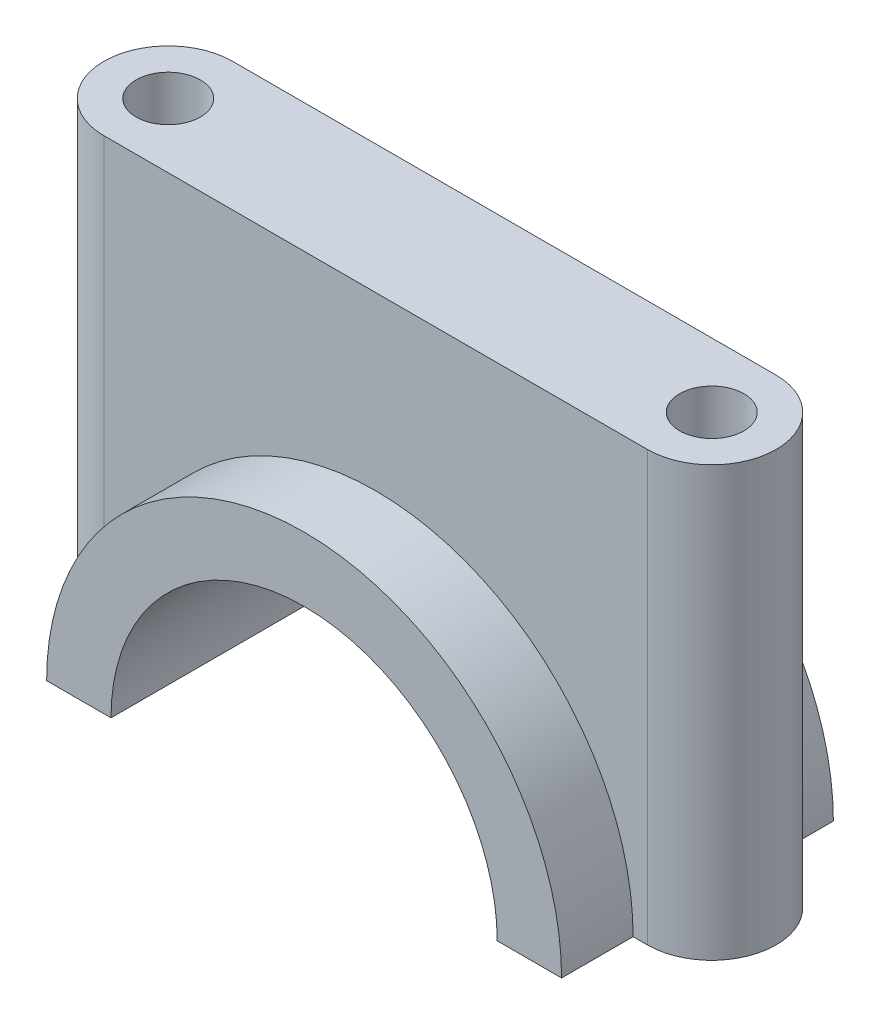
ISO-10303-21;
HEADER;
FILE_DESCRIPTION(('STEP AP214'),'2;1');
FILE_NAME('part.step','',(''),(''),'','','');
FILE_SCHEMA(('AUTOMOTIVE_DESIGN { 1 0 10303 214 1 1 1 1 }'));
ENDSEC;
DATA;
#1=APPLICATION_CONTEXT('core data for automotive mechanical design processes');
#2=APPLICATION_PROTOCOL_DEFINITION('international standard','automotive_design',2000,#1);
#3=PRODUCT_CONTEXT('',#1,'mechanical');
#4=PRODUCT('Part','Part','',(#3));
#5=PRODUCT_RELATED_PRODUCT_CATEGORY('part','',(#4));
#6=PRODUCT_DEFINITION_FORMATION('','',#4);
#7=PRODUCT_DEFINITION_CONTEXT('part definition',#1,'design');
#8=PRODUCT_DEFINITION('design','',#6,#7);
#9=PRODUCT_DEFINITION_SHAPE('','',#8);
#10=(LENGTH_UNIT() NAMED_UNIT(*) SI_UNIT(.MILLI.,.METRE.));
#11=(NAMED_UNIT(*) PLANE_ANGLE_UNIT() SI_UNIT($,.RADIAN.));
#12=(NAMED_UNIT(*) SI_UNIT($,.STERADIAN.) SOLID_ANGLE_UNIT());
#13=UNCERTAINTY_MEASURE_WITH_UNIT(LENGTH_MEASURE(1.E-05),#10,'distance_accuracy_value','');
#14=(GEOMETRIC_REPRESENTATION_CONTEXT(3) GLOBAL_UNCERTAINTY_ASSIGNED_CONTEXT((#13)) GLOBAL_UNIT_ASSIGNED_CONTEXT((#10,
#11,#12)) REPRESENTATION_CONTEXT('',''));
#15=CARTESIAN_POINT('',(0.,0.,0.));
#16=DIRECTION('',(0.,0.,1.));
#17=DIRECTION('',(1.,0.,0.));
#18=AXIS2_PLACEMENT_3D('',#15,#16,#17);
#19=CARTESIAN_POINT('',(-36.,0.,19.));
#20=DIRECTION('',(0.,1.,0.));
#21=DIRECTION('',(0.,0.,1.));
#22=AXIS2_PLACEMENT_3D('',#19,#20,#21);
#23=PLANE('',#22);
#24=CARTESIAN_POINT('',(-38.,0.,0.));
#25=DIRECTION('',(0.,-1.,0.));
#26=DIRECTION('',(0.,0.,-1.));
#27=AXIS2_PLACEMENT_3D('',#24,#25,#26);
#28=CIRCLE('',#27,4.5);
#29=CARTESIAN_POINT('',(-38.,0.,-4.5));
#30=VERTEX_POINT('',#29);
#31=EDGE_CURVE('E158',#30,#30,#28,.T.);
#32=ORIENTED_EDGE('',*,*,#31,.F.);
#33=EDGE_LOOP('',(#32));
#34=FACE_BOUND('',#33,.T.);
#35=DIRECTION('',(1.,0.,0.));
#36=VECTOR('',#35,1.);
#37=CARTESIAN_POINT('',(-36.,0.,-19.));
#38=LINE('',#37,#36);
#39=CARTESIAN_POINT('',(-36.,0.,-19.));
#40=VERTEX_POINT('',#39);
#41=CARTESIAN_POINT('',(-27.,0.,-19.));
#42=VERTEX_POINT('',#41);
#43=EDGE_CURVE('E190',#40,#42,#38,.T.);
#44=ORIENTED_EDGE('',*,*,#43,.T.);
#45=DIRECTION('',(0.,0.,-1.));
#46=VECTOR('',#45,1.);
#47=CARTESIAN_POINT('',(-27.,0.,19.));
#48=LINE('',#47,#46);
#49=CARTESIAN_POINT('',(-27.,0.,19.));
#50=VERTEX_POINT('',#49);
#51=EDGE_CURVE('E83',#50,#42,#48,.T.);
#52=ORIENTED_EDGE('',*,*,#51,.F.);
#53=DIRECTION('',(1.,0.,0.));
#54=VECTOR('',#53,1.);
#55=CARTESIAN_POINT('',(-36.,0.,19.));
#56=LINE('',#55,#54);
#57=CARTESIAN_POINT('',(-36.,0.,19.));
#58=VERTEX_POINT('',#57);
#59=EDGE_CURVE('E64',#58,#50,#56,.T.);
#60=ORIENTED_EDGE('',*,*,#59,.F.);
#61=DIRECTION('',(0.,0.,-1.));
#62=VECTOR('',#61,1.);
#63=CARTESIAN_POINT('',(-36.,0.,19.));
#64=LINE('',#63,#62);
#65=CARTESIAN_POINT('',(-36.,0.,8.99999999999998));
#66=VERTEX_POINT('',#65);
#67=EDGE_CURVE('E213',#58,#66,#64,.T.);
#68=ORIENTED_EDGE('',*,*,#67,.T.);
#69=DIRECTION('',(1.,0.,0.));
#70=VECTOR('',#69,1.);
#71=CARTESIAN_POINT('',(38.,0.,9.));
#72=LINE('',#71,#70);
#73=CARTESIAN_POINT('',(-38.,0.,9.));
#74=VERTEX_POINT('',#73);
#75=EDGE_CURVE('E239',#74,#66,#72,.T.);
#76=ORIENTED_EDGE('',*,*,#75,.F.);
#77=CARTESIAN_POINT('',(-38.,0.,0.));
#78=DIRECTION('',(0.,1.,0.));
#79=DIRECTION('',(0.,0.,1.));
#80=AXIS2_PLACEMENT_3D('',#77,#78,#79);
#81=CIRCLE('',#80,9.);
#82=CARTESIAN_POINT('',(-38.,0.,-9.00000000000001));
#83=VERTEX_POINT('',#82);
#84=EDGE_CURVE('E179',#83,#74,#81,.T.);
#85=ORIENTED_EDGE('',*,*,#84,.F.);
#86=DIRECTION('',(-1.,0.,0.));
#87=VECTOR('',#86,1.);
#88=CARTESIAN_POINT('',(38.,0.,-9.));
#89=LINE('',#88,#87);
#90=CARTESIAN_POINT('',(-36.,0.,-9.00000000000001));
#91=VERTEX_POINT('',#90);
#92=EDGE_CURVE('E55',#91,#83,#89,.T.);
#93=ORIENTED_EDGE('',*,*,#92,.F.);
#94=EDGE_CURVE('E212',#91,#40,#64,.T.);
#95=ORIENTED_EDGE('',*,*,#94,.T.);
#96=EDGE_LOOP('',(#44,#52,#60,#68,#76,#85,#93,#95));
#97=FACE_BOUND('',#96,.T.);
#98=ADVANCED_FACE('F39',(#34,#97),#23,.F.);
#99=CARTESIAN_POINT('',(0.,0.,19.));
#100=DIRECTION('',(0.,0.,-1.));
#101=DIRECTION('',(-1.,0.,0.));
#102=AXIS2_PLACEMENT_3D('',#99,#100,#101);
#103=CYLINDRICAL_SURFACE('',#102,27.);
#104=ORIENTED_EDGE('',*,*,#51,.T.);
#105=CARTESIAN_POINT('',(0.,0.,-19.));
#106=DIRECTION('',(0.,0.,-1.));
#107=DIRECTION('',(1.,0.,0.));
#108=AXIS2_PLACEMENT_3D('',#105,#106,#107);
#109=CIRCLE('',#108,27.);
#110=CARTESIAN_POINT('',(27.,0.,-19.));
#111=VERTEX_POINT('',#110);
#112=EDGE_CURVE('E186',#42,#111,#109,.T.);
#113=ORIENTED_EDGE('',*,*,#112,.T.);
#114=DIRECTION('',(0.,0.,-1.));
#115=VECTOR('',#114,1.);
#116=CARTESIAN_POINT('',(27.,0.,19.));
#117=LINE('',#116,#115);
#118=CARTESIAN_POINT('',(27.,0.,19.));
#119=VERTEX_POINT('',#118);
#120=EDGE_CURVE('E11',#119,#111,#117,.T.);
#121=ORIENTED_EDGE('',*,*,#120,.F.);
#122=CARTESIAN_POINT('',(0.,0.,19.));
#123=DIRECTION('',(0.,0.,-1.));
#124=DIRECTION('',(1.,0.,0.));
#125=AXIS2_PLACEMENT_3D('',#122,#123,#124);
#126=CIRCLE('',#125,27.);
#127=EDGE_CURVE('E187',#50,#119,#126,.T.);
#128=ORIENTED_EDGE('',*,*,#127,.F.);
#129=EDGE_LOOP('',(#104,#113,#121,#128));
#130=FACE_BOUND('',#129,.T.);
#131=ADVANCED_FACE('F41',(#130),#103,.F.);
#132=CARTESIAN_POINT('',(0.,0.,19.));
#133=DIRECTION('',(0.,0.,-1.));
#134=DIRECTION('',(-1.,0.,0.));
#135=AXIS2_PLACEMENT_3D('',#132,#133,#134);
#136=CYLINDRICAL_SURFACE('',#135,36.);
#137=CARTESIAN_POINT('',(0.,0.,-9.00000000000001));
#138=DIRECTION('',(0.,0.,1.));
#139=DIRECTION('',(1.,0.,0.));
#140=AXIS2_PLACEMENT_3D('',#137,#138,#139);
#141=CIRCLE('',#140,36.);
#142=CARTESIAN_POINT('',(36.,0.,-9.));
#143=VERTEX_POINT('',#142);
#144=EDGE_CURVE('E183',#143,#91,#141,.T.);
#145=ORIENTED_EDGE('',*,*,#144,.F.);
#146=DIRECTION('',(0.,0.,-1.));
#147=VECTOR('',#146,1.);
#148=CARTESIAN_POINT('',(36.,0.,19.));
#149=LINE('',#148,#147);
#150=CARTESIAN_POINT('',(36.,0.,-19.));
#151=VERTEX_POINT('',#150);
#152=EDGE_CURVE('E216',#143,#151,#149,.T.);
#153=ORIENTED_EDGE('',*,*,#152,.T.);
#154=CARTESIAN_POINT('',(0.,0.,-19.));
#155=DIRECTION('',(0.,0.,1.));
#156=DIRECTION('',(1.,0.,0.));
#157=AXIS2_PLACEMENT_3D('',#154,#155,#156);
#158=CIRCLE('',#157,36.);
#159=EDGE_CURVE('E204',#151,#40,#158,.T.);
#160=ORIENTED_EDGE('',*,*,#159,.T.);
#161=ORIENTED_EDGE('',*,*,#94,.F.);
#162=EDGE_LOOP('',(#145,#153,#160,#161));
#163=FACE_BOUND('',#162,.T.);
#164=ADVANCED_FACE('F226',(#163),#136,.T.);
#165=CARTESIAN_POINT('',(0.,0.,8.99999999999999));
#166=DIRECTION('',(0.,0.,-1.));
#167=DIRECTION('',(-1.,0.,0.));
#168=AXIS2_PLACEMENT_3D('',#165,#166,#167);
#169=CIRCLE('',#168,36.);
#170=CARTESIAN_POINT('',(36.,0.,9.));
#171=VERTEX_POINT('',#170);
#172=EDGE_CURVE('E180',#66,#171,#169,.T.);
#173=ORIENTED_EDGE('',*,*,#172,.F.);
#174=ORIENTED_EDGE('',*,*,#67,.F.);
#175=CARTESIAN_POINT('',(0.,0.,19.));
#176=DIRECTION('',(0.,0.,1.));
#177=DIRECTION('',(1.,0.,0.));
#178=AXIS2_PLACEMENT_3D('',#175,#176,#177);
#179=CIRCLE('',#178,36.);
#180=CARTESIAN_POINT('',(36.,0.,19.));
#181=VERTEX_POINT('',#180);
#182=EDGE_CURVE('E193',#181,#58,#179,.T.);
#183=ORIENTED_EDGE('',*,*,#182,.F.);
#184=EDGE_CURVE('E48',#181,#171,#149,.T.);
#185=ORIENTED_EDGE('',*,*,#184,.T.);
#186=EDGE_LOOP('',(#173,#174,#183,#185));
#187=FACE_BOUND('',#186,.T.);
#188=ADVANCED_FACE('F251',(#187),#136,.T.);
#189=CARTESIAN_POINT('',(38.,0.,0.));
#190=DIRECTION('',(0.,-1.,0.));
#191=DIRECTION('',(0.,0.,-1.));
#192=AXIS2_PLACEMENT_3D('',#189,#190,#191);
#193=CIRCLE('',#192,4.5);
#194=CARTESIAN_POINT('',(38.,0.,-4.5));
#195=VERTEX_POINT('',#194);
#196=EDGE_CURVE('E273',#195,#195,#193,.T.);
#197=ORIENTED_EDGE('',*,*,#196,.F.);
#198=EDGE_LOOP('',(#197));
#199=FACE_BOUND('',#198,.T.);
#200=ORIENTED_EDGE('',*,*,#120,.T.);
#201=DIRECTION('',(1.,0.,0.));
#202=VECTOR('',#201,1.);
#203=CARTESIAN_POINT('',(27.,0.,-19.));
#204=LINE('',#203,#202);
#205=EDGE_CURVE('E200',#111,#151,#204,.T.);
#206=ORIENTED_EDGE('',*,*,#205,.T.);
#207=ORIENTED_EDGE('',*,*,#152,.F.);
#208=CARTESIAN_POINT('',(38.,0.,-9.));
#209=VERTEX_POINT('',#208);
#210=EDGE_CURVE('E176',#209,#143,#89,.T.);
#211=ORIENTED_EDGE('',*,*,#210,.F.);
#212=CARTESIAN_POINT('',(38.,0.,0.));
#213=DIRECTION('',(0.,1.,0.));
#214=DIRECTION('',(0.,0.,1.));
#215=AXIS2_PLACEMENT_3D('',#212,#213,#214);
#216=CIRCLE('',#215,9.);
#217=CARTESIAN_POINT('',(38.,0.,9.));
#218=VERTEX_POINT('',#217);
#219=EDGE_CURVE('E161',#218,#209,#216,.T.);
#220=ORIENTED_EDGE('',*,*,#219,.F.);
#221=EDGE_CURVE('E132',#171,#218,#72,.T.);
#222=ORIENTED_EDGE('',*,*,#221,.F.);
#223=ORIENTED_EDGE('',*,*,#184,.F.);
#224=DIRECTION('',(1.,0.,0.));
#225=VECTOR('',#224,1.);
#226=CARTESIAN_POINT('',(27.,0.,19.));
#227=LINE('',#226,#225);
#228=EDGE_CURVE('E90',#119,#181,#227,.T.);
#229=ORIENTED_EDGE('',*,*,#228,.F.);
#230=EDGE_LOOP('',(#200,#206,#207,#211,#220,#222,#223,#229));
#231=FACE_BOUND('',#230,.T.);
#232=ADVANCED_FACE('F231',(#199,#231),#23,.F.);
#233=CARTESIAN_POINT('',(0.,0.,19.));
#234=DIRECTION('',(0.,0.,1.));
#235=DIRECTION('',(1.,0.,0.));
#236=AXIS2_PLACEMENT_3D('',#233,#234,#235);
#237=PLANE('',#236);
#238=ORIENTED_EDGE('',*,*,#127,.T.);
#239=ORIENTED_EDGE('',*,*,#228,.T.);
#240=ORIENTED_EDGE('',*,*,#182,.T.);
#241=ORIENTED_EDGE('',*,*,#59,.T.);
#242=EDGE_LOOP('',(#238,#239,#240,#241));
#243=FACE_BOUND('',#242,.T.);
#244=ADVANCED_FACE('F252',(#243),#237,.T.);
#245=CARTESIAN_POINT('',(0.,0.,-19.));
#246=DIRECTION('',(0.,0.,1.));
#247=DIRECTION('',(1.,0.,0.));
#248=AXIS2_PLACEMENT_3D('',#245,#246,#247);
#249=PLANE('',#248);
#250=ORIENTED_EDGE('',*,*,#112,.F.);
#251=ORIENTED_EDGE('',*,*,#43,.F.);
#252=ORIENTED_EDGE('',*,*,#159,.F.);
#253=ORIENTED_EDGE('',*,*,#205,.F.);
#254=EDGE_LOOP('',(#250,#251,#252,#253));
#255=FACE_BOUND('',#254,.T.);
#256=ADVANCED_FACE('F235',(#255),#249,.F.);
#257=CARTESIAN_POINT('',(38.,-95.7078889120432,0.));
#258=DIRECTION('',(0.,1.,0.));
#259=DIRECTION('',(0.,0.,1.));
#260=AXIS2_PLACEMENT_3D('',#257,#258,#259);
#261=CYLINDRICAL_SURFACE('',#260,9.);
#262=DIRECTION('',(0.,1.,0.));
#263=VECTOR('',#262,1.);
#264=CARTESIAN_POINT('',(38.,-95.7078889120432,9.));
#265=LINE('',#264,#263);
#266=CARTESIAN_POINT('',(38.,60.,9.));
#267=VERTEX_POINT('',#266);
#268=EDGE_CURVE('E125',#218,#267,#265,.T.);
#269=ORIENTED_EDGE('',*,*,#268,.F.);
#270=ORIENTED_EDGE('',*,*,#219,.T.);
#271=DIRECTION('',(0.,1.,0.));
#272=VECTOR('',#271,1.);
#273=CARTESIAN_POINT('',(38.,-95.7078889120432,-9.));
#274=LINE('',#273,#272);
#275=CARTESIAN_POINT('',(38.,60.,-9.));
#276=VERTEX_POINT('',#275);
#277=EDGE_CURVE('E151',#209,#276,#274,.T.);
#278=ORIENTED_EDGE('',*,*,#277,.T.);
#279=CARTESIAN_POINT('',(38.,60.,0.));
#280=DIRECTION('',(0.,-1.,0.));
#281=DIRECTION('',(0.,0.,-1.));
#282=AXIS2_PLACEMENT_3D('',#279,#280,#281);
#283=CIRCLE('',#282,9.);
#284=EDGE_CURVE('E144',#276,#267,#283,.T.);
#285=ORIENTED_EDGE('',*,*,#284,.T.);
#286=EDGE_LOOP('',(#269,#270,#278,#285));
#287=FACE_BOUND('',#286,.T.);
#288=ADVANCED_FACE('F149',(#287),#261,.T.);
#289=CARTESIAN_POINT('',(-38.,-95.7078889120432,0.));
#290=DIRECTION('',(0.,1.,0.));
#291=DIRECTION('',(0.,0.,1.));
#292=AXIS2_PLACEMENT_3D('',#289,#290,#291);
#293=CYLINDRICAL_SURFACE('',#292,9.);
#294=DIRECTION('',(0.,1.,0.));
#295=VECTOR('',#294,1.);
#296=CARTESIAN_POINT('',(-38.,-95.7078889120432,-9.00000000000001));
#297=LINE('',#296,#295);
#298=CARTESIAN_POINT('',(-38.,60.,-9.00000000000001));
#299=VERTEX_POINT('',#298);
#300=EDGE_CURVE('E171',#83,#299,#297,.T.);
#301=ORIENTED_EDGE('',*,*,#300,.F.);
#302=ORIENTED_EDGE('',*,*,#84,.T.);
#303=DIRECTION('',(0.,1.,0.));
#304=VECTOR('',#303,1.);
#305=CARTESIAN_POINT('',(-38.,-95.7078889120432,9.));
#306=LINE('',#305,#304);
#307=CARTESIAN_POINT('',(-38.,60.,9.));
#308=VERTEX_POINT('',#307);
#309=EDGE_CURVE('E138',#74,#308,#306,.T.);
#310=ORIENTED_EDGE('',*,*,#309,.T.);
#311=CARTESIAN_POINT('',(-38.,60.,0.));
#312=DIRECTION('',(0.,-1.,0.));
#313=DIRECTION('',(0.,0.,-1.));
#314=AXIS2_PLACEMENT_3D('',#311,#312,#313);
#315=CIRCLE('',#314,9.);
#316=EDGE_CURVE('E146',#308,#299,#315,.T.);
#317=ORIENTED_EDGE('',*,*,#316,.T.);
#318=EDGE_LOOP('',(#301,#302,#310,#317));
#319=FACE_BOUND('',#318,.T.);
#320=ADVANCED_FACE('F249',(#319),#293,.T.);
#321=CARTESIAN_POINT('',(38.,60.,0.));
#322=DIRECTION('',(0.,-1.,0.));
#323=DIRECTION('',(0.,0.,-1.));
#324=AXIS2_PLACEMENT_3D('',#321,#322,#323);
#325=PLANE('',#324);
#326=CARTESIAN_POINT('',(-38.,60.,0.));
#327=DIRECTION('',(0.,-1.,0.));
#328=DIRECTION('',(0.,0.,-1.));
#329=AXIS2_PLACEMENT_3D('',#326,#327,#328);
#330=CIRCLE('',#329,4.5);
#331=CARTESIAN_POINT('',(-38.,60.,-4.5));
#332=VERTEX_POINT('',#331);
#333=EDGE_CURVE('E154',#332,#332,#330,.T.);
#334=ORIENTED_EDGE('',*,*,#333,.T.);
#335=EDGE_LOOP('',(#334));
#336=FACE_BOUND('',#335,.T.);
#337=CARTESIAN_POINT('',(38.,60.,0.));
#338=DIRECTION('',(0.,-1.,0.));
#339=DIRECTION('',(0.,0.,-1.));
#340=AXIS2_PLACEMENT_3D('',#337,#338,#339);
#341=CIRCLE('',#340,4.5);
#342=CARTESIAN_POINT('',(38.,60.,-4.5));
#343=VERTEX_POINT('',#342);
#344=EDGE_CURVE('E276',#343,#343,#341,.T.);
#345=ORIENTED_EDGE('',*,*,#344,.T.);
#346=EDGE_LOOP('',(#345));
#347=FACE_BOUND('',#346,.T.);
#348=ORIENTED_EDGE('',*,*,#284,.F.);
#349=DIRECTION('',(1.,0.,0.));
#350=VECTOR('',#349,1.);
#351=CARTESIAN_POINT('',(38.,60.,-9.));
#352=LINE('',#351,#350);
#353=EDGE_CURVE('E166',#299,#276,#352,.T.);
#354=ORIENTED_EDGE('',*,*,#353,.F.);
#355=ORIENTED_EDGE('',*,*,#316,.F.);
#356=DIRECTION('',(-1.,0.,0.));
#357=VECTOR('',#356,1.);
#358=CARTESIAN_POINT('',(38.,60.,9.));
#359=LINE('',#358,#357);
#360=EDGE_CURVE('E129',#267,#308,#359,.T.);
#361=ORIENTED_EDGE('',*,*,#360,.F.);
#362=EDGE_LOOP('',(#348,#354,#355,#361));
#363=FACE_BOUND('',#362,.T.);
#364=ADVANCED_FACE('F142',(#336,#347,#363),#325,.F.);
#365=CARTESIAN_POINT('',(38.,-95.7078889120432,9.));
#366=DIRECTION('',(0.,0.,-1.));
#367=DIRECTION('',(-1.,0.,0.));
#368=AXIS2_PLACEMENT_3D('',#365,#366,#367);
#369=PLANE('',#368);
#370=ORIENTED_EDGE('',*,*,#75,.T.);
#371=ORIENTED_EDGE('',*,*,#172,.T.);
#372=ORIENTED_EDGE('',*,*,#221,.T.);
#373=ORIENTED_EDGE('',*,*,#268,.T.);
#374=ORIENTED_EDGE('',*,*,#360,.T.);
#375=ORIENTED_EDGE('',*,*,#309,.F.);
#376=EDGE_LOOP('',(#370,#371,#372,#373,#374,#375));
#377=FACE_BOUND('',#376,.T.);
#378=ADVANCED_FACE('F127',(#377),#369,.F.);
#379=CARTESIAN_POINT('',(38.,-95.7078889120432,-9.));
#380=DIRECTION('',(0.,0.,1.));
#381=DIRECTION('',(1.,0.,0.));
#382=AXIS2_PLACEMENT_3D('',#379,#380,#381);
#383=PLANE('',#382);
#384=ORIENTED_EDGE('',*,*,#210,.T.);
#385=ORIENTED_EDGE('',*,*,#144,.T.);
#386=ORIENTED_EDGE('',*,*,#92,.T.);
#387=ORIENTED_EDGE('',*,*,#300,.T.);
#388=ORIENTED_EDGE('',*,*,#353,.T.);
#389=ORIENTED_EDGE('',*,*,#277,.F.);
#390=EDGE_LOOP('',(#384,#385,#386,#387,#388,#389));
#391=FACE_BOUND('',#390,.T.);
#392=ADVANCED_FACE('F246',(#391),#383,.F.);
#393=CARTESIAN_POINT('',(38.,60.,0.));
#394=DIRECTION('',(0.,-1.,0.));
#395=DIRECTION('',(0.,0.,-1.));
#396=AXIS2_PLACEMENT_3D('',#393,#394,#395);
#397=CYLINDRICAL_SURFACE('',#396,4.5);
#398=ORIENTED_EDGE('',*,*,#344,.F.);
#399=EDGE_LOOP('',(#398));
#400=FACE_BOUND('',#399,.T.);
#401=ORIENTED_EDGE('',*,*,#196,.T.);
#402=EDGE_LOOP('',(#401));
#403=FACE_BOUND('',#402,.T.);
#404=ADVANCED_FACE('F287',(#400,#403),#397,.F.);
#405=CARTESIAN_POINT('',(-38.,60.,0.));
#406=DIRECTION('',(0.,-1.,0.));
#407=DIRECTION('',(0.,0.,-1.));
#408=AXIS2_PLACEMENT_3D('',#405,#406,#407);
#409=CYLINDRICAL_SURFACE('',#408,4.5);
#410=ORIENTED_EDGE('',*,*,#333,.F.);
#411=EDGE_LOOP('',(#410));
#412=FACE_BOUND('',#411,.T.);
#413=ORIENTED_EDGE('',*,*,#31,.T.);
#414=EDGE_LOOP('',(#413));
#415=FACE_BOUND('',#414,.T.);
#416=ADVANCED_FACE('F285',(#412,#415),#409,.F.);
#417=CLOSED_SHELL('',(#98,#131,#164,#188,#232,#244,#256,#288,#320,#364,#378,#392,#404,#416));
#418=MANIFOLD_SOLID_BREP('B2',#417);
#419=ADVANCED_BREP_SHAPE_REPRESENTATION('',(#18,#418),#14);
#420=SHAPE_DEFINITION_REPRESENTATION(#9,#419);
ENDSEC;
END-ISO-10303-21;
